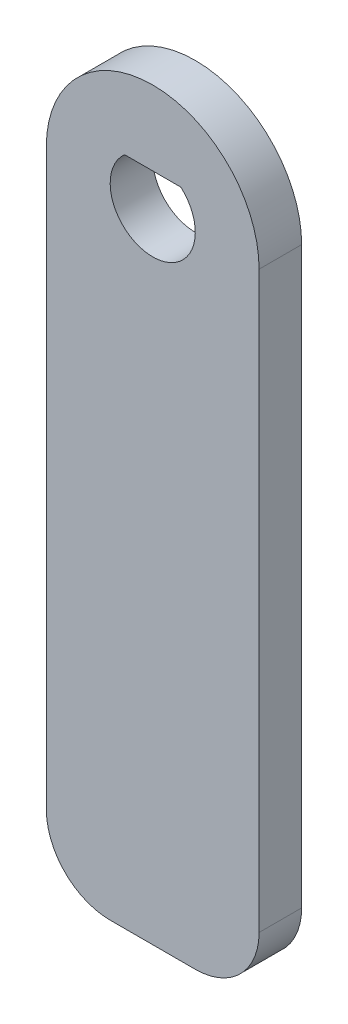
ISO-10303-21;
HEADER;
FILE_DESCRIPTION(('STEP AP214'),'2;1');
FILE_NAME('part.step','',(''),(''),'','','');
FILE_SCHEMA(('AUTOMOTIVE_DESIGN { 1 0 10303 214 1 1 1 1 }'));
ENDSEC;
DATA;
#1=APPLICATION_CONTEXT('core data for automotive mechanical design processes');
#2=APPLICATION_PROTOCOL_DEFINITION('international standard','automotive_design',2000,#1);
#3=PRODUCT_CONTEXT('',#1,'mechanical');
#4=PRODUCT('Part','Part','',(#3));
#5=PRODUCT_RELATED_PRODUCT_CATEGORY('part','',(#4));
#6=PRODUCT_DEFINITION_FORMATION('','',#4);
#7=PRODUCT_DEFINITION_CONTEXT('part definition',#1,'design');
#8=PRODUCT_DEFINITION('design','',#6,#7);
#9=PRODUCT_DEFINITION_SHAPE('','',#8);
#10=(LENGTH_UNIT() NAMED_UNIT(*) SI_UNIT(.MILLI.,.METRE.));
#11=(NAMED_UNIT(*) PLANE_ANGLE_UNIT() SI_UNIT($,.RADIAN.));
#12=(NAMED_UNIT(*) SI_UNIT($,.STERADIAN.) SOLID_ANGLE_UNIT());
#13=UNCERTAINTY_MEASURE_WITH_UNIT(LENGTH_MEASURE(1.E-05),#10,'distance_accuracy_value','');
#14=(GEOMETRIC_REPRESENTATION_CONTEXT(3) GLOBAL_UNCERTAINTY_ASSIGNED_CONTEXT((#13)) GLOBAL_UNIT_ASSIGNED_CONTEXT((#10,
#11,#12)) REPRESENTATION_CONTEXT('',''));
#15=CARTESIAN_POINT('',(0.,0.,0.));
#16=DIRECTION('',(0.,0.,1.));
#17=DIRECTION('',(1.,0.,0.));
#18=AXIS2_PLACEMENT_3D('',#15,#16,#17);
#19=CARTESIAN_POINT('',(2.,-27.,2.));
#20=DIRECTION('',(0.,0.,-1.));
#21=DIRECTION('',(-1.,0.,0.));
#22=AXIS2_PLACEMENT_3D('',#19,#20,#21);
#23=PLANE('',#22);
#24=CARTESIAN_POINT('',(2.,-27.,2.));
#25=DIRECTION('',(0.,0.,1.));
#26=DIRECTION('',(-1.,0.,0.));
#27=AXIS2_PLACEMENT_3D('',#24,#25,#26);
#28=CIRCLE('',#27,3.);
#29=CARTESIAN_POINT('',(1.99999999999998,-30.,2.));
#30=VERTEX_POINT('',#29);
#31=CARTESIAN_POINT('',(5.,-27.,2.));
#32=VERTEX_POINT('',#31);
#33=EDGE_CURVE('E133',#30,#32,#28,.T.);
#34=ORIENTED_EDGE('',*,*,#33,.T.);
#35=DIRECTION('',(0.,1.,0.));
#36=VECTOR('',#35,1.);
#37=CARTESIAN_POINT('',(5.,-27.,2.));
#38=LINE('',#37,#36);
#39=CARTESIAN_POINT('',(5.,0.,2.));
#40=VERTEX_POINT('',#39);
#41=EDGE_CURVE('E137',#32,#40,#38,.T.);
#42=ORIENTED_EDGE('',*,*,#41,.T.);
#43=CARTESIAN_POINT('',(0.,0.,2.));
#44=DIRECTION('',(0.,0.,1.));
#45=DIRECTION('',(1.,0.,0.));
#46=AXIS2_PLACEMENT_3D('',#43,#44,#45);
#47=CIRCLE('',#46,5.);
#48=CARTESIAN_POINT('',(-5.,0.,2.));
#49=VERTEX_POINT('',#48);
#50=EDGE_CURVE('E141',#40,#49,#47,.T.);
#51=ORIENTED_EDGE('',*,*,#50,.T.);
#52=DIRECTION('',(0.,-1.,0.));
#53=VECTOR('',#52,1.);
#54=CARTESIAN_POINT('',(-5.,0.,2.));
#55=LINE('',#54,#53);
#56=CARTESIAN_POINT('',(-5.,-27.,2.));
#57=VERTEX_POINT('',#56);
#58=EDGE_CURVE('E144',#49,#57,#55,.T.);
#59=ORIENTED_EDGE('',*,*,#58,.T.);
#60=CARTESIAN_POINT('',(-2.,-27.,2.));
#61=DIRECTION('',(0.,0.,1.));
#62=DIRECTION('',(-1.,0.,0.));
#63=AXIS2_PLACEMENT_3D('',#60,#61,#62);
#64=CIRCLE('',#63,3.);
#65=CARTESIAN_POINT('',(-1.99999999999998,-30.,2.));
#66=VERTEX_POINT('',#65);
#67=EDGE_CURVE('E147',#57,#66,#64,.T.);
#68=ORIENTED_EDGE('',*,*,#67,.T.);
#69=DIRECTION('',(1.,0.,0.));
#70=VECTOR('',#69,1.);
#71=CARTESIAN_POINT('',(-1.99999999999998,-30.,2.));
#72=LINE('',#71,#70);
#73=EDGE_CURVE('E150',#66,#30,#72,.T.);
#74=ORIENTED_EDGE('',*,*,#73,.T.);
#75=EDGE_LOOP('',(#34,#42,#51,#59,#68,#74));
#76=FACE_BOUND('',#75,.T.);
#77=CARTESIAN_POINT('',(0.,0.,2.));
#78=DIRECTION('',(0.,0.,1.));
#79=DIRECTION('',(1.,0.,0.));
#80=AXIS2_PLACEMENT_3D('',#77,#78,#79);
#81=CIRCLE('',#80,2.);
#82=CARTESIAN_POINT('',(-1.3228756555323,1.5,2.));
#83=VERTEX_POINT('',#82);
#84=CARTESIAN_POINT('',(1.32287565553229,1.5,2.));
#85=VERTEX_POINT('',#84);
#86=EDGE_CURVE('E117',#83,#85,#81,.T.);
#87=ORIENTED_EDGE('',*,*,#86,.F.);
#88=DIRECTION('',(-1.,0.,0.));
#89=VECTOR('',#88,1.);
#90=CARTESIAN_POINT('',(-1.3228756555323,1.5,2.));
#91=LINE('',#90,#89);
#92=EDGE_CURVE('E110',#85,#83,#91,.T.);
#93=ORIENTED_EDGE('',*,*,#92,.F.);
#94=EDGE_LOOP('',(#87,#93));
#95=FACE_BOUND('',#94,.T.);
#96=ADVANCED_FACE('F45',(#76,#95),#23,.F.);
#97=CARTESIAN_POINT('',(2.,-27.,0.));
#98=DIRECTION('',(0.,0.,-1.));
#99=DIRECTION('',(-1.,0.,0.));
#100=AXIS2_PLACEMENT_3D('',#97,#98,#99);
#101=PLANE('',#100);
#102=CARTESIAN_POINT('',(2.,-27.,0.));
#103=DIRECTION('',(0.,0.,1.));
#104=DIRECTION('',(-1.,0.,0.));
#105=AXIS2_PLACEMENT_3D('',#102,#103,#104);
#106=CIRCLE('',#105,3.);
#107=CARTESIAN_POINT('',(1.99999999999998,-30.,0.));
#108=VERTEX_POINT('',#107);
#109=CARTESIAN_POINT('',(5.,-27.,0.));
#110=VERTEX_POINT('',#109);
#111=EDGE_CURVE('E132',#108,#110,#106,.T.);
#112=ORIENTED_EDGE('',*,*,#111,.F.);
#113=DIRECTION('',(1.,0.,0.));
#114=VECTOR('',#113,1.);
#115=CARTESIAN_POINT('',(-1.99999999999998,-30.,0.));
#116=LINE('',#115,#114);
#117=CARTESIAN_POINT('',(-1.99999999999998,-30.,0.));
#118=VERTEX_POINT('',#117);
#119=EDGE_CURVE('E138',#118,#108,#116,.T.);
#120=ORIENTED_EDGE('',*,*,#119,.F.);
#121=CARTESIAN_POINT('',(-2.,-27.,0.));
#122=DIRECTION('',(0.,0.,1.));
#123=DIRECTION('',(-1.,0.,0.));
#124=AXIS2_PLACEMENT_3D('',#121,#122,#123);
#125=CIRCLE('',#124,3.);
#126=CARTESIAN_POINT('',(-5.,-27.,0.));
#127=VERTEX_POINT('',#126);
#128=EDGE_CURVE('E166',#127,#118,#125,.T.);
#129=ORIENTED_EDGE('',*,*,#128,.F.);
#130=DIRECTION('',(0.,-1.,0.));
#131=VECTOR('',#130,1.);
#132=CARTESIAN_POINT('',(-5.,0.,0.));
#133=LINE('',#132,#131);
#134=CARTESIAN_POINT('',(-5.,0.,0.));
#135=VERTEX_POINT('',#134);
#136=EDGE_CURVE('E163',#135,#127,#133,.T.);
#137=ORIENTED_EDGE('',*,*,#136,.F.);
#138=CARTESIAN_POINT('',(0.,0.,0.));
#139=DIRECTION('',(0.,0.,1.));
#140=DIRECTION('',(1.,0.,0.));
#141=AXIS2_PLACEMENT_3D('',#138,#139,#140);
#142=CIRCLE('',#141,5.);
#143=CARTESIAN_POINT('',(5.,0.,0.));
#144=VERTEX_POINT('',#143);
#145=EDGE_CURVE('E160',#144,#135,#142,.T.);
#146=ORIENTED_EDGE('',*,*,#145,.F.);
#147=DIRECTION('',(0.,1.,0.));
#148=VECTOR('',#147,1.);
#149=CARTESIAN_POINT('',(5.,-27.,0.));
#150=LINE('',#149,#148);
#151=EDGE_CURVE('E157',#110,#144,#150,.T.);
#152=ORIENTED_EDGE('',*,*,#151,.F.);
#153=EDGE_LOOP('',(#112,#120,#129,#137,#146,#152));
#154=FACE_BOUND('',#153,.T.);
#155=DIRECTION('',(-1.,0.,0.));
#156=VECTOR('',#155,1.);
#157=CARTESIAN_POINT('',(-1.3228756555323,1.5,0.));
#158=LINE('',#157,#156);
#159=CARTESIAN_POINT('',(1.3228756555323,1.5,0.));
#160=VERTEX_POINT('',#159);
#161=CARTESIAN_POINT('',(-1.32287565553229,1.5,0.));
#162=VERTEX_POINT('',#161);
#163=EDGE_CURVE('E123',#160,#162,#158,.T.);
#164=ORIENTED_EDGE('',*,*,#163,.T.);
#165=CARTESIAN_POINT('',(0.,0.,0.));
#166=DIRECTION('',(0.,0.,1.));
#167=DIRECTION('',(1.,0.,0.));
#168=AXIS2_PLACEMENT_3D('',#165,#166,#167);
#169=CIRCLE('',#168,2.);
#170=EDGE_CURVE('E68',#162,#160,#169,.T.);
#171=ORIENTED_EDGE('',*,*,#170,.T.);
#172=EDGE_LOOP('',(#164,#171));
#173=FACE_BOUND('',#172,.T.);
#174=ADVANCED_FACE('F197',(#154,#173),#101,.T.);
#175=CARTESIAN_POINT('',(2.,-27.,2.));
#176=DIRECTION('',(0.,0.,-1.));
#177=DIRECTION('',(-1.,0.,0.));
#178=AXIS2_PLACEMENT_3D('',#175,#176,#177);
#179=CYLINDRICAL_SURFACE('',#178,3.);
#180=ORIENTED_EDGE('',*,*,#111,.T.);
#181=DIRECTION('',(0.,0.,-1.));
#182=VECTOR('',#181,1.);
#183=CARTESIAN_POINT('',(5.,-27.,2.));
#184=LINE('',#183,#182);
#185=EDGE_CURVE('E11',#32,#110,#184,.T.);
#186=ORIENTED_EDGE('',*,*,#185,.F.);
#187=ORIENTED_EDGE('',*,*,#33,.F.);
#188=DIRECTION('',(0.,0.,-1.));
#189=VECTOR('',#188,1.);
#190=CARTESIAN_POINT('',(1.99999999999998,-30.,2.));
#191=LINE('',#190,#189);
#192=EDGE_CURVE('E153',#30,#108,#191,.T.);
#193=ORIENTED_EDGE('',*,*,#192,.T.);
#194=EDGE_LOOP('',(#180,#186,#187,#193));
#195=FACE_BOUND('',#194,.T.);
#196=ADVANCED_FACE('F47',(#195),#179,.T.);
#197=CARTESIAN_POINT('',(5.,-27.,2.));
#198=DIRECTION('',(-1.,0.,0.));
#199=DIRECTION('',(0.,0.,1.));
#200=AXIS2_PLACEMENT_3D('',#197,#198,#199);
#201=PLANE('',#200);
#202=ORIENTED_EDGE('',*,*,#151,.T.);
#203=DIRECTION('',(0.,0.,-1.));
#204=VECTOR('',#203,1.);
#205=CARTESIAN_POINT('',(5.,0.,2.));
#206=LINE('',#205,#204);
#207=EDGE_CURVE('E54',#40,#144,#206,.T.);
#208=ORIENTED_EDGE('',*,*,#207,.F.);
#209=ORIENTED_EDGE('',*,*,#41,.F.);
#210=ORIENTED_EDGE('',*,*,#185,.T.);
#211=EDGE_LOOP('',(#202,#208,#209,#210));
#212=FACE_BOUND('',#211,.T.);
#213=ADVANCED_FACE('F214',(#212),#201,.F.);
#214=CARTESIAN_POINT('',(0.,0.,2.));
#215=DIRECTION('',(0.,0.,-1.));
#216=DIRECTION('',(-1.,0.,0.));
#217=AXIS2_PLACEMENT_3D('',#214,#215,#216);
#218=CYLINDRICAL_SURFACE('',#217,5.);
#219=ORIENTED_EDGE('',*,*,#145,.T.);
#220=DIRECTION('',(0.,0.,-1.));
#221=VECTOR('',#220,1.);
#222=CARTESIAN_POINT('',(-5.,0.,2.));
#223=LINE('',#222,#221);
#224=EDGE_CURVE('E182',#49,#135,#223,.T.);
#225=ORIENTED_EDGE('',*,*,#224,.F.);
#226=ORIENTED_EDGE('',*,*,#50,.F.);
#227=ORIENTED_EDGE('',*,*,#207,.T.);
#228=EDGE_LOOP('',(#219,#225,#226,#227));
#229=FACE_BOUND('',#228,.T.);
#230=ADVANCED_FACE('F191',(#229),#218,.T.);
#231=CARTESIAN_POINT('',(-5.,0.,2.));
#232=DIRECTION('',(1.,0.,0.));
#233=DIRECTION('',(0.,0.,-1.));
#234=AXIS2_PLACEMENT_3D('',#231,#232,#233);
#235=PLANE('',#234);
#236=ORIENTED_EDGE('',*,*,#136,.T.);
#237=DIRECTION('',(0.,0.,-1.));
#238=VECTOR('',#237,1.);
#239=CARTESIAN_POINT('',(-5.,-27.,2.));
#240=LINE('',#239,#238);
#241=EDGE_CURVE('E178',#57,#127,#240,.T.);
#242=ORIENTED_EDGE('',*,*,#241,.F.);
#243=ORIENTED_EDGE('',*,*,#58,.F.);
#244=ORIENTED_EDGE('',*,*,#224,.T.);
#245=EDGE_LOOP('',(#236,#242,#243,#244));
#246=FACE_BOUND('',#245,.T.);
#247=ADVANCED_FACE('F203',(#246),#235,.F.);
#248=CARTESIAN_POINT('',(-2.,-27.,2.));
#249=DIRECTION('',(0.,0.,-1.));
#250=DIRECTION('',(-1.,0.,0.));
#251=AXIS2_PLACEMENT_3D('',#248,#249,#250);
#252=CYLINDRICAL_SURFACE('',#251,3.);
#253=ORIENTED_EDGE('',*,*,#128,.T.);
#254=DIRECTION('',(0.,0.,-1.));
#255=VECTOR('',#254,1.);
#256=CARTESIAN_POINT('',(-1.99999999999998,-30.,2.));
#257=LINE('',#256,#255);
#258=EDGE_CURVE('E174',#66,#118,#257,.T.);
#259=ORIENTED_EDGE('',*,*,#258,.F.);
#260=ORIENTED_EDGE('',*,*,#67,.F.);
#261=ORIENTED_EDGE('',*,*,#241,.T.);
#262=EDGE_LOOP('',(#253,#259,#260,#261));
#263=FACE_BOUND('',#262,.T.);
#264=ADVANCED_FACE('F207',(#263),#252,.T.);
#265=CARTESIAN_POINT('',(-1.99999999999998,-30.,2.));
#266=DIRECTION('',(0.,1.,0.));
#267=DIRECTION('',(0.,0.,1.));
#268=AXIS2_PLACEMENT_3D('',#265,#266,#267);
#269=PLANE('',#268);
#270=ORIENTED_EDGE('',*,*,#119,.T.);
#271=ORIENTED_EDGE('',*,*,#192,.F.);
#272=ORIENTED_EDGE('',*,*,#73,.F.);
#273=ORIENTED_EDGE('',*,*,#258,.T.);
#274=EDGE_LOOP('',(#270,#271,#272,#273));
#275=FACE_BOUND('',#274,.T.);
#276=ADVANCED_FACE('F217',(#275),#269,.F.);
#277=CARTESIAN_POINT('',(0.,0.,2.));
#278=DIRECTION('',(0.,0.,-1.));
#279=DIRECTION('',(-1.,0.,0.));
#280=AXIS2_PLACEMENT_3D('',#277,#278,#279);
#281=CYLINDRICAL_SURFACE('',#280,2.);
#282=ORIENTED_EDGE('',*,*,#170,.F.);
#283=DIRECTION('',(0.,0.,-1.));
#284=VECTOR('',#283,1.);
#285=CARTESIAN_POINT('',(-1.3228756555323,1.5,2.));
#286=LINE('',#285,#284);
#287=EDGE_CURVE('E112',#83,#162,#286,.T.);
#288=ORIENTED_EDGE('',*,*,#287,.F.);
#289=ORIENTED_EDGE('',*,*,#86,.T.);
#290=DIRECTION('',(0.,0.,-1.));
#291=VECTOR('',#290,1.);
#292=CARTESIAN_POINT('',(1.3228756555323,1.5,2.));
#293=LINE('',#292,#291);
#294=EDGE_CURVE('E61',#85,#160,#293,.T.);
#295=ORIENTED_EDGE('',*,*,#294,.T.);
#296=EDGE_LOOP('',(#282,#288,#289,#295));
#297=FACE_BOUND('',#296,.T.);
#298=ADVANCED_FACE('F119',(#297),#281,.F.);
#299=CARTESIAN_POINT('',(-1.3228756555323,1.5,2.));
#300=DIRECTION('',(0.,-1.,0.));
#301=DIRECTION('',(0.,0.,-1.));
#302=AXIS2_PLACEMENT_3D('',#299,#300,#301);
#303=PLANE('',#302);
#304=ORIENTED_EDGE('',*,*,#163,.F.);
#305=ORIENTED_EDGE('',*,*,#294,.F.);
#306=ORIENTED_EDGE('',*,*,#92,.T.);
#307=ORIENTED_EDGE('',*,*,#287,.T.);
#308=EDGE_LOOP('',(#304,#305,#306,#307));
#309=FACE_BOUND('',#308,.T.);
#310=ADVANCED_FACE('F111',(#309),#303,.T.);
#311=CLOSED_SHELL('',(#96,#174,#196,#213,#230,#247,#264,#276,#298,#310));
#312=MANIFOLD_SOLID_BREP('B2',#311);
#313=ADVANCED_BREP_SHAPE_REPRESENTATION('',(#18,#312),#14);
#314=SHAPE_DEFINITION_REPRESENTATION(#9,#313);
ENDSEC;
END-ISO-10303-21;
